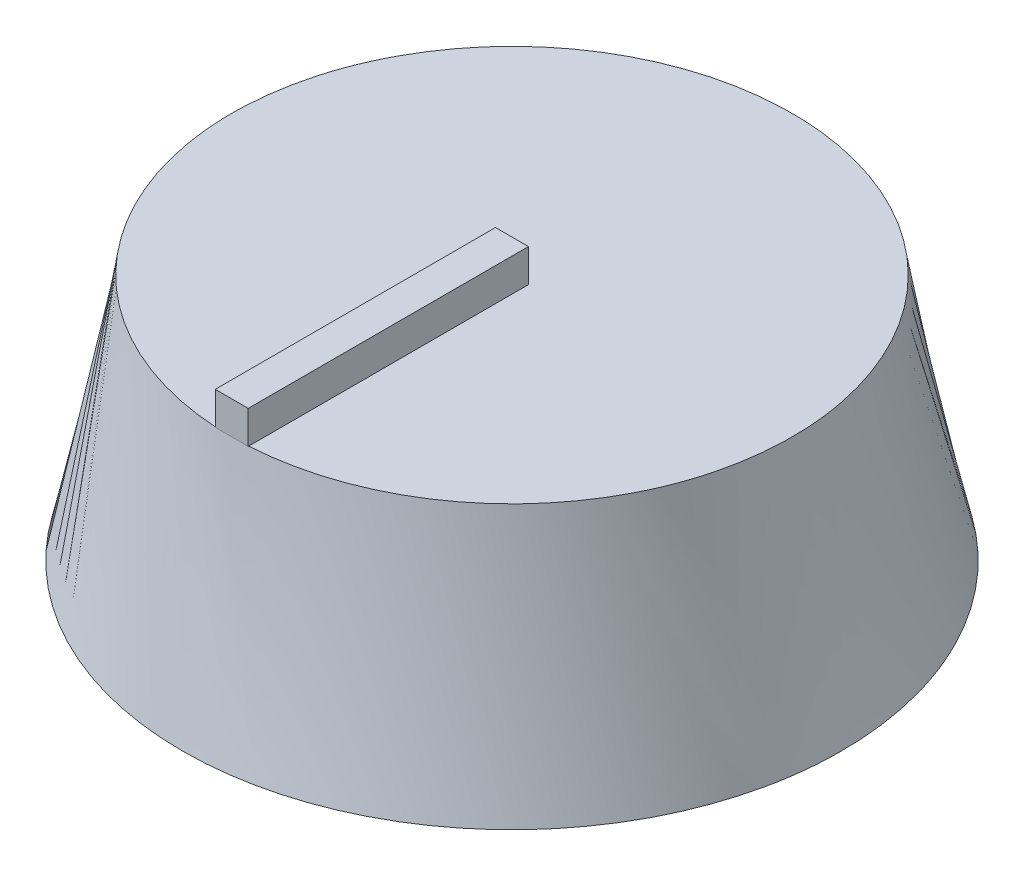
ISO-10303-21;
HEADER;
FILE_DESCRIPTION(('STEP AP214'),'2;1');
FILE_NAME('part.step','',(''),(''),'','','');
FILE_SCHEMA(('AUTOMOTIVE_DESIGN { 1 0 10303 214 1 1 1 1 }'));
ENDSEC;
DATA;
#1=APPLICATION_CONTEXT('core data for automotive mechanical design processes');
#2=APPLICATION_PROTOCOL_DEFINITION('international standard','automotive_design',2000,#1);
#3=PRODUCT_CONTEXT('',#1,'mechanical');
#4=PRODUCT('Part','Part','',(#3));
#5=PRODUCT_RELATED_PRODUCT_CATEGORY('part','',(#4));
#6=PRODUCT_DEFINITION_FORMATION('','',#4);
#7=PRODUCT_DEFINITION_CONTEXT('part definition',#1,'design');
#8=PRODUCT_DEFINITION('design','',#6,#7);
#9=PRODUCT_DEFINITION_SHAPE('','',#8);
#10=(LENGTH_UNIT() NAMED_UNIT(*) SI_UNIT(.MILLI.,.METRE.));
#11=(NAMED_UNIT(*) PLANE_ANGLE_UNIT() SI_UNIT($,.RADIAN.));
#12=(NAMED_UNIT(*) SI_UNIT($,.STERADIAN.) SOLID_ANGLE_UNIT());
#13=UNCERTAINTY_MEASURE_WITH_UNIT(LENGTH_MEASURE(1.E-05),#10,'distance_accuracy_value','');
#14=(GEOMETRIC_REPRESENTATION_CONTEXT(3) GLOBAL_UNCERTAINTY_ASSIGNED_CONTEXT((#13)) GLOBAL_UNIT_ASSIGNED_CONTEXT((#10,
#11,#12)) REPRESENTATION_CONTEXT('',''));
#15=CARTESIAN_POINT('',(0.,0.,0.));
#16=DIRECTION('',(0.,0.,1.));
#17=DIRECTION('',(1.,0.,0.));
#18=AXIS2_PLACEMENT_3D('',#15,#16,#17);
#19=CARTESIAN_POINT('',(0.,15.,0.));
#20=DIRECTION('',(0.,1.,0.));
#21=DIRECTION('',(0.,0.,1.));
#22=AXIS2_PLACEMENT_3D('',#19,#20,#21);
#23=PLANE('',#22);
#24=CARTESIAN_POINT('',(0.,15.,0.));
#25=DIRECTION('',(0.,1.,0.));
#26=DIRECTION('',(0.,0.,1.));
#27=AXIS2_PLACEMENT_3D('',#24,#25,#26);
#28=CIRCLE('',#27,17.);
#29=CARTESIAN_POINT('',(1.00000010586958,15.,16.9705645442119));
#30=VERTEX_POINT('',#29);
#31=CARTESIAN_POINT('',(-0.999999932866143,15.,16.9705616091241));
#32=VERTEX_POINT('',#31);
#33=EDGE_CURVE('E47',#30,#32,#28,.T.);
#34=ORIENTED_EDGE('',*,*,#33,.T.);
#35=DIRECTION('',(0.,0.,-1.));
#36=VECTOR('',#35,1.);
#37=CARTESIAN_POINT('',(-1.,15.,0.));
#38=LINE('',#37,#36);
#39=CARTESIAN_POINT('',(-1.,15.,0.));
#40=VERTEX_POINT('',#39);
#41=EDGE_CURVE('E61',#40,#32,#38,.F.);
#42=ORIENTED_EDGE('',*,*,#41,.F.);
#43=DIRECTION('',(1.,0.,0.));
#44=VECTOR('',#43,1.);
#45=CARTESIAN_POINT('',(-1.,15.,0.));
#46=LINE('',#45,#44);
#47=CARTESIAN_POINT('',(1.,15.,0.));
#48=VERTEX_POINT('',#47);
#49=EDGE_CURVE('E66',#40,#48,#46,.T.);
#50=ORIENTED_EDGE('',*,*,#49,.T.);
#51=DIRECTION('',(0.,0.,-1.));
#52=VECTOR('',#51,1.);
#53=CARTESIAN_POINT('',(1.,15.,0.));
#54=LINE('',#53,#52);
#55=EDGE_CURVE('E149',#48,#30,#54,.F.);
#56=ORIENTED_EDGE('',*,*,#55,.T.);
#57=EDGE_LOOP('',(#34,#42,#50,#56));
#58=FACE_BOUND('',#57,.T.);
#59=ADVANCED_FACE('F43',(#58),#23,.T.);
#60=CARTESIAN_POINT('',(0.,0.,0.));
#61=DIRECTION('',(0.,1.,0.));
#62=DIRECTION('',(0.,0.,1.));
#63=AXIS2_PLACEMENT_3D('',#60,#61,#62);
#64=PLANE('',#63);
#65=CARTESIAN_POINT('',(0.,0.,0.));
#66=DIRECTION('',(0.,1.,0.));
#67=DIRECTION('',(0.,0.,1.));
#68=AXIS2_PLACEMENT_3D('',#65,#66,#67);
#69=CIRCLE('',#68,20.);
#70=CARTESIAN_POINT('',(0.,0.,20.));
#71=VERTEX_POINT('',#70);
#72=EDGE_CURVE('E121',#71,#71,#69,.T.);
#73=ORIENTED_EDGE('',*,*,#72,.F.);
#74=EDGE_LOOP('',(#73));
#75=FACE_BOUND('',#74,.T.);
#76=ADVANCED_FACE('F198',(#75),#64,.F.);
#77=CARTESIAN_POINT('',(19.8546431751067,0.,-2.40689517619423));
#78=CARTESIAN_POINT('',(16.7989736248748,15.,2.60662332352833));
#79=CARTESIAN_POINT('',(15.0408528227183,0.,-42.1161815264077));
#80=CARTESIAN_POINT('',(22.0122202719314,15.,-30.9913239262212));
#81=CARTESIAN_POINT('',(-24.6684335274952,0.,-37.3023911740193));
#82=CARTESIAN_POINT('',(-11.5857269778181,15.,-36.2045705732779));
#83=CARTESIAN_POINT('',(-19.8546431751067,0.,2.40689517619423));
#84=CARTESIAN_POINT('',(-16.7989736248748,15.,-2.60662332352834));
#85=CARTESIAN_POINT('',(-15.0408528227183,0.,42.1161815264077));
#86=CARTESIAN_POINT('',(-22.0122202719314,15.,30.9913239262212));
#87=CARTESIAN_POINT('',(24.6684335274952,0.,37.3023911740193));
#88=CARTESIAN_POINT('',(11.5857269778181,15.,36.2045705732779));
#89=CARTESIAN_POINT('',(19.8546431751067,0.,-2.40689517619423));
#90=CARTESIAN_POINT('',(16.7989736248748,15.,2.60662332352833));
#91=(BOUNDED_SURFACE() B_SPLINE_SURFACE(3,1,((#77,#78),(#79,#80),(#81,#82),(#83,#84),(#85,#86),
(#87,#88),(#89,#90)),.UNSPECIFIED.,.T.,.F.,.F.) B_SPLINE_SURFACE_WITH_KNOTS((4,3,4),(2,2),(0.,
0.5,1.),(0.,1.),.UNSPECIFIED.) GEOMETRIC_REPRESENTATION_ITEM() RATIONAL_B_SPLINE_SURFACE(((1.,
1.),(0.333333333333333,0.333333333333333),(0.333333333333333,0.333333333333333),(1.,1.),
(0.333333333333333,0.333333333333333),(0.333333333333333,0.333333333333333),(1.,1.))) REPRESENTATION_ITEM('') SURFACE());
#92=CARTESIAN_POINT('',(0.,15.,17.));
#93=VERTEX_POINT('',#92);
#94=EDGE_CURVE('E12',#93,#30,#28,.T.);
#95=CARTESIAN_POINT('',(-0.00292281999303071,15.,16.9999997489788));
#96=VERTEX_POINT('',#95);
#97=EDGE_CURVE('E169',#96,#93,#28,.T.);
#98=EDGE_CURVE('E241',#32,#96,#28,.T.);
#99=ORIENTED_EDGE('',*,*,#72,.T.);
#100=EDGE_LOOP('',(#99));
#101=FACE_BOUND('',#100,.T.);
#102=ORIENTED_EDGE('',*,*,#94,.F.);
#103=ORIENTED_EDGE('',*,*,#97,.F.);
#104=ORIENTED_EDGE('',*,*,#98,.F.);
#105=ORIENTED_EDGE('',*,*,#33,.F.);
#106=EDGE_LOOP('',(#102,#103,#104,#105));
#107=FACE_BOUND('',#106,.T.);
#108=ADVANCED_FACE('F186',(#101,#107),#91,.T.);
#109=CARTESIAN_POINT('',(0.,15.,0.));
#110=DIRECTION('',(0.,1.,0.));
#111=DIRECTION('',(1.,0.,0.));
#112=AXIS2_PLACEMENT_3D('',#109,#110,#111);
#113=PLANE('',#112);
#114=ORIENTED_EDGE('',*,*,#94,.T.);
#115=CARTESIAN_POINT('',(1.,15.,17.));
#116=VERTEX_POINT('',#115);
#117=EDGE_CURVE('E146',#30,#116,#54,.F.);
#118=ORIENTED_EDGE('',*,*,#117,.T.);
#119=DIRECTION('',(-1.,0.,0.));
#120=VECTOR('',#119,1.);
#121=CARTESIAN_POINT('',(1.,15.,17.));
#122=LINE('',#121,#120);
#123=EDGE_CURVE('E150',#116,#93,#122,.T.);
#124=ORIENTED_EDGE('',*,*,#123,.T.);
#125=EDGE_LOOP('',(#114,#118,#124));
#126=FACE_BOUND('',#125,.T.);
#127=ADVANCED_FACE('F197',(#126),#113,.F.);
#128=CARTESIAN_POINT('',(-1.,17.,0.));
#129=DIRECTION('',(1.,0.,0.));
#130=DIRECTION('',(0.,0.,-1.));
#131=AXIS2_PLACEMENT_3D('',#128,#129,#130);
#132=PLANE('',#131);
#133=ORIENTED_EDGE('',*,*,#41,.T.);
#134=CARTESIAN_POINT('',(-1.,15.,17.));
#135=VERTEX_POINT('',#134);
#136=EDGE_CURVE('E117',#32,#135,#38,.F.);
#137=ORIENTED_EDGE('',*,*,#136,.T.);
#138=DIRECTION('',(0.,-1.,0.));
#139=VECTOR('',#138,1.);
#140=CARTESIAN_POINT('',(-1.,17.,17.));
#141=LINE('',#140,#139);
#142=CARTESIAN_POINT('',(-1.,17.,17.));
#143=VERTEX_POINT('',#142);
#144=EDGE_CURVE('E114',#143,#135,#141,.T.);
#145=ORIENTED_EDGE('',*,*,#144,.F.);
#146=DIRECTION('',(0.,0.,-1.));
#147=VECTOR('',#146,1.);
#148=CARTESIAN_POINT('',(-1.,17.,0.));
#149=LINE('',#148,#147);
#150=CARTESIAN_POINT('',(-1.,17.,0.));
#151=VERTEX_POINT('',#150);
#152=EDGE_CURVE('E100',#151,#143,#149,.F.);
#153=ORIENTED_EDGE('',*,*,#152,.F.);
#154=DIRECTION('',(0.,-1.,0.));
#155=VECTOR('',#154,1.);
#156=CARTESIAN_POINT('',(-1.,17.,0.));
#157=LINE('',#156,#155);
#158=EDGE_CURVE('E135',#151,#40,#157,.T.);
#159=ORIENTED_EDGE('',*,*,#158,.T.);
#160=EDGE_LOOP('',(#133,#137,#145,#153,#159));
#161=FACE_BOUND('',#160,.T.);
#162=ADVANCED_FACE('F115',(#161),#132,.F.);
#163=CARTESIAN_POINT('',(1.,17.,17.));
#164=DIRECTION('',(0.,0.,1.));
#165=DIRECTION('',(1.,0.,0.));
#166=AXIS2_PLACEMENT_3D('',#163,#164,#165);
#167=PLANE('',#166);
#168=ORIENTED_EDGE('',*,*,#123,.F.);
#169=DIRECTION('',(0.,-1.,0.));
#170=VECTOR('',#169,1.);
#171=CARTESIAN_POINT('',(1.,17.,17.));
#172=LINE('',#171,#170);
#173=CARTESIAN_POINT('',(1.,17.,17.));
#174=VERTEX_POINT('',#173);
#175=EDGE_CURVE('E122',#174,#116,#172,.T.);
#176=ORIENTED_EDGE('',*,*,#175,.F.);
#177=DIRECTION('',(-1.,0.,0.));
#178=VECTOR('',#177,1.);
#179=CARTESIAN_POINT('',(1.,17.,17.));
#180=LINE('',#179,#178);
#181=EDGE_CURVE('E105',#174,#143,#180,.T.);
#182=ORIENTED_EDGE('',*,*,#181,.T.);
#183=ORIENTED_EDGE('',*,*,#144,.T.);
#184=EDGE_CURVE('E145',#96,#135,#122,.T.);
#185=ORIENTED_EDGE('',*,*,#184,.F.);
#186=ORIENTED_EDGE('',*,*,#97,.T.);
#187=EDGE_LOOP('',(#168,#176,#182,#183,#185,#186));
#188=FACE_BOUND('',#187,.T.);
#189=ADVANCED_FACE('F125',(#188),#167,.T.);
#190=CARTESIAN_POINT('',(1.,17.,0.));
#191=DIRECTION('',(1.,0.,0.));
#192=DIRECTION('',(0.,0.,-1.));
#193=AXIS2_PLACEMENT_3D('',#190,#191,#192);
#194=PLANE('',#193);
#195=ORIENTED_EDGE('',*,*,#55,.F.);
#196=DIRECTION('',(0.,-1.,0.));
#197=VECTOR('',#196,1.);
#198=CARTESIAN_POINT('',(1.,17.,0.));
#199=LINE('',#198,#197);
#200=CARTESIAN_POINT('',(1.,17.,0.));
#201=VERTEX_POINT('',#200);
#202=EDGE_CURVE('E159',#201,#48,#199,.T.);
#203=ORIENTED_EDGE('',*,*,#202,.F.);
#204=DIRECTION('',(0.,0.,-1.));
#205=VECTOR('',#204,1.);
#206=CARTESIAN_POINT('',(1.,17.,0.));
#207=LINE('',#206,#205);
#208=EDGE_CURVE('E128',#201,#174,#207,.F.);
#209=ORIENTED_EDGE('',*,*,#208,.T.);
#210=ORIENTED_EDGE('',*,*,#175,.T.);
#211=ORIENTED_EDGE('',*,*,#117,.F.);
#212=EDGE_LOOP('',(#195,#203,#209,#210,#211));
#213=FACE_BOUND('',#212,.T.);
#214=ADVANCED_FACE('F166',(#213),#194,.T.);
#215=CARTESIAN_POINT('',(-1.,17.,0.));
#216=DIRECTION('',(0.,0.,-1.));
#217=DIRECTION('',(-1.,0.,0.));
#218=AXIS2_PLACEMENT_3D('',#215,#216,#217);
#219=PLANE('',#218);
#220=ORIENTED_EDGE('',*,*,#49,.F.);
#221=ORIENTED_EDGE('',*,*,#158,.F.);
#222=DIRECTION('',(1.,0.,0.));
#223=VECTOR('',#222,1.);
#224=CARTESIAN_POINT('',(-1.,17.,0.));
#225=LINE('',#224,#223);
#226=EDGE_CURVE('E108',#151,#201,#225,.T.);
#227=ORIENTED_EDGE('',*,*,#226,.T.);
#228=ORIENTED_EDGE('',*,*,#202,.T.);
#229=EDGE_LOOP('',(#220,#221,#227,#228));
#230=FACE_BOUND('',#229,.T.);
#231=ADVANCED_FACE('F252',(#230),#219,.T.);
#232=CARTESIAN_POINT('',(0.,17.,0.));
#233=DIRECTION('',(0.,1.,0.));
#234=DIRECTION('',(1.,0.,0.));
#235=AXIS2_PLACEMENT_3D('',#232,#233,#234);
#236=PLANE('',#235);
#237=ORIENTED_EDGE('',*,*,#152,.T.);
#238=ORIENTED_EDGE('',*,*,#181,.F.);
#239=ORIENTED_EDGE('',*,*,#208,.F.);
#240=ORIENTED_EDGE('',*,*,#226,.F.);
#241=EDGE_LOOP('',(#237,#238,#239,#240));
#242=FACE_BOUND('',#241,.T.);
#243=ADVANCED_FACE('F102',(#242),#236,.T.);
#244=ORIENTED_EDGE('',*,*,#98,.T.);
#245=ORIENTED_EDGE('',*,*,#184,.T.);
#246=ORIENTED_EDGE('',*,*,#136,.F.);
#247=EDGE_LOOP('',(#244,#245,#246));
#248=FACE_BOUND('',#247,.T.);
#249=ADVANCED_FACE('F256',(#248),#113,.F.);
#250=CLOSED_SHELL('',(#59,#76,#108,#127,#162,#189,#214,#231,#243,#249));
#251=MANIFOLD_SOLID_BREP('B2',#250);
#252=ADVANCED_BREP_SHAPE_REPRESENTATION('',(#18,#251),#14);
#253=SHAPE_DEFINITION_REPRESENTATION(#9,#252);
ENDSEC;
END-ISO-10303-21;
